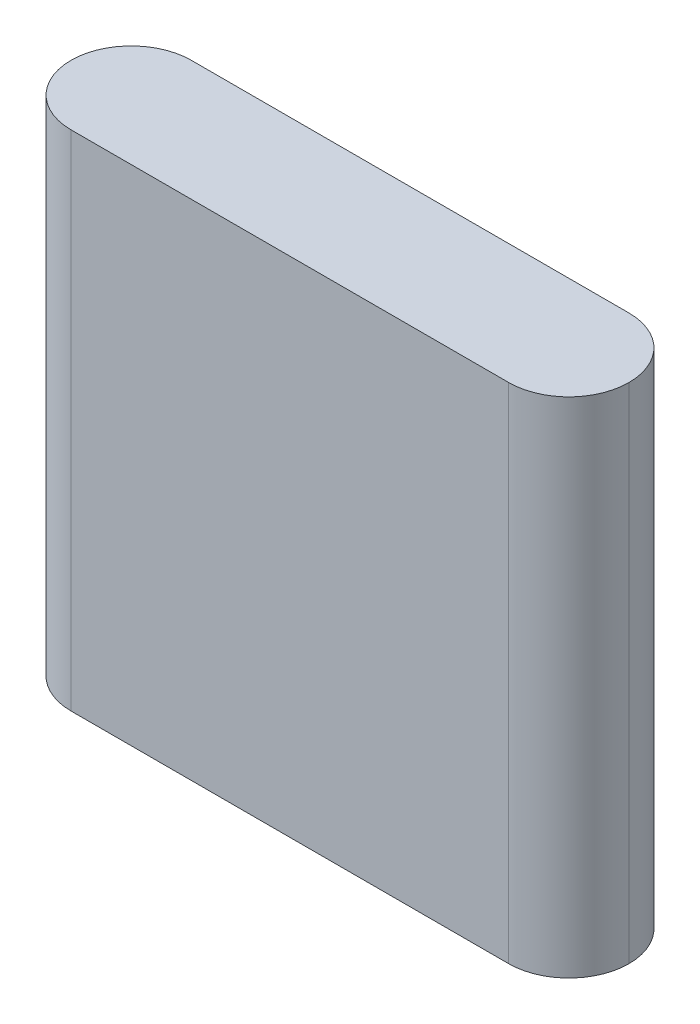
ISO-10303-21;
HEADER;
FILE_DESCRIPTION(('STEP AP214'),'2;1');
FILE_NAME('part.step','',(''),(''),'','','');
FILE_SCHEMA(('AUTOMOTIVE_DESIGN { 1 0 10303 214 1 1 1 1 }'));
ENDSEC;
DATA;
#1=APPLICATION_CONTEXT('core data for automotive mechanical design processes');
#2=APPLICATION_PROTOCOL_DEFINITION('international standard','automotive_design',2000,#1);
#3=PRODUCT_CONTEXT('',#1,'mechanical');
#4=PRODUCT('Part','Part','',(#3));
#5=PRODUCT_RELATED_PRODUCT_CATEGORY('part','',(#4));
#6=PRODUCT_DEFINITION_FORMATION('','',#4);
#7=PRODUCT_DEFINITION_CONTEXT('part definition',#1,'design');
#8=PRODUCT_DEFINITION('design','',#6,#7);
#9=PRODUCT_DEFINITION_SHAPE('','',#8);
#10=(LENGTH_UNIT() NAMED_UNIT(*) SI_UNIT(.MILLI.,.METRE.));
#11=(NAMED_UNIT(*) PLANE_ANGLE_UNIT() SI_UNIT($,.RADIAN.));
#12=(NAMED_UNIT(*) SI_UNIT($,.STERADIAN.) SOLID_ANGLE_UNIT());
#13=UNCERTAINTY_MEASURE_WITH_UNIT(LENGTH_MEASURE(1.E-05),#10,'distance_accuracy_value','');
#14=(GEOMETRIC_REPRESENTATION_CONTEXT(3) GLOBAL_UNCERTAINTY_ASSIGNED_CONTEXT((#13)) GLOBAL_UNIT_ASSIGNED_CONTEXT((#10,
#11,#12)) REPRESENTATION_CONTEXT('',''));
#15=CARTESIAN_POINT('',(0.,0.,0.));
#16=DIRECTION('',(0.,0.,1.));
#17=DIRECTION('',(1.,0.,0.));
#18=AXIS2_PLACEMENT_3D('',#15,#16,#17);
#19=CARTESIAN_POINT('',(-25.5,23.,11.));
#20=DIRECTION('',(0.,-1.,0.));
#21=DIRECTION('',(0.,0.,-1.));
#22=AXIS2_PLACEMENT_3D('',#19,#20,#21);
#23=PLANE('',#22);
#24=CARTESIAN_POINT('',(-20.,23.,5.5));
#25=DIRECTION('',(0.,-1.,0.));
#26=DIRECTION('',(0.,0.,-1.));
#27=AXIS2_PLACEMENT_3D('',#24,#25,#26);
#28=CIRCLE('',#27,5.5);
#29=CARTESIAN_POINT('',(-20.,23.,0.));
#30=VERTEX_POINT('',#29);
#31=CARTESIAN_POINT('',(-25.5,23.,5.5));
#32=VERTEX_POINT('',#31);
#33=EDGE_CURVE('E49',#30,#32,#28,.F.);
#34=ORIENTED_EDGE('',*,*,#33,.T.);
#35=CARTESIAN_POINT('',(-20.,23.,5.5));
#36=DIRECTION('',(0.,-1.,0.));
#37=DIRECTION('',(0.,0.,-1.));
#38=AXIS2_PLACEMENT_3D('',#35,#36,#37);
#39=CIRCLE('',#38,5.5);
#40=CARTESIAN_POINT('',(-20.,23.,11.));
#41=VERTEX_POINT('',#40);
#42=EDGE_CURVE('E108',#32,#41,#39,.F.);
#43=ORIENTED_EDGE('',*,*,#42,.T.);
#44=DIRECTION('',(-1.,0.,0.));
#45=VECTOR('',#44,1.);
#46=CARTESIAN_POINT('',(-25.5,23.,11.));
#47=LINE('',#46,#45);
#48=CARTESIAN_POINT('',(20.,23.,11.));
#49=VERTEX_POINT('',#48);
#50=EDGE_CURVE('E101',#49,#41,#47,.T.);
#51=ORIENTED_EDGE('',*,*,#50,.F.);
#52=CARTESIAN_POINT('',(20.,23.,5.5));
#53=DIRECTION('',(0.,-1.,0.));
#54=DIRECTION('',(0.,0.,-1.));
#55=AXIS2_PLACEMENT_3D('',#52,#53,#54);
#56=CIRCLE('',#55,5.5);
#57=CARTESIAN_POINT('',(25.5,23.,5.5));
#58=VERTEX_POINT('',#57);
#59=EDGE_CURVE('E88',#49,#58,#56,.F.);
#60=ORIENTED_EDGE('',*,*,#59,.T.);
#61=CARTESIAN_POINT('',(20.,23.,5.5));
#62=DIRECTION('',(0.,-1.,0.));
#63=DIRECTION('',(0.,0.,-1.));
#64=AXIS2_PLACEMENT_3D('',#61,#62,#63);
#65=CIRCLE('',#64,5.5);
#66=CARTESIAN_POINT('',(20.,23.,0.));
#67=VERTEX_POINT('',#66);
#68=EDGE_CURVE('E128',#58,#67,#65,.F.);
#69=ORIENTED_EDGE('',*,*,#68,.T.);
#70=DIRECTION('',(-1.,0.,0.));
#71=VECTOR('',#70,1.);
#72=CARTESIAN_POINT('',(-25.5,23.,0.));
#73=LINE('',#72,#71);
#74=EDGE_CURVE('E113',#67,#30,#73,.T.);
#75=ORIENTED_EDGE('',*,*,#74,.T.);
#76=EDGE_LOOP('',(#34,#43,#51,#60,#69,#75));
#77=FACE_BOUND('',#76,.T.);
#78=ADVANCED_FACE('F33',(#77),#23,.F.);
#79=CARTESIAN_POINT('',(-25.5,-23.,11.));
#80=DIRECTION('',(0.,1.,0.));
#81=DIRECTION('',(0.,0.,1.));
#82=AXIS2_PLACEMENT_3D('',#79,#80,#81);
#83=PLANE('',#82);
#84=DIRECTION('',(1.,0.,0.));
#85=VECTOR('',#84,1.);
#86=CARTESIAN_POINT('',(-25.5,-23.,11.));
#87=LINE('',#86,#85);
#88=CARTESIAN_POINT('',(-20.,-23.,11.));
#89=VERTEX_POINT('',#88);
#90=CARTESIAN_POINT('',(20.,-23.,11.));
#91=VERTEX_POINT('',#90);
#92=EDGE_CURVE('E104',#89,#91,#87,.T.);
#93=ORIENTED_EDGE('',*,*,#92,.F.);
#94=CARTESIAN_POINT('',(-20.,-23.,5.5));
#95=DIRECTION('',(0.,1.,0.));
#96=DIRECTION('',(0.,0.,1.));
#97=AXIS2_PLACEMENT_3D('',#94,#95,#96);
#98=CIRCLE('',#97,5.5);
#99=CARTESIAN_POINT('',(-25.5,-23.,5.5));
#100=VERTEX_POINT('',#99);
#101=EDGE_CURVE('E126',#89,#100,#98,.F.);
#102=ORIENTED_EDGE('',*,*,#101,.T.);
#103=CARTESIAN_POINT('',(-20.,-23.,5.5));
#104=DIRECTION('',(0.,1.,0.));
#105=DIRECTION('',(0.,0.,1.));
#106=AXIS2_PLACEMENT_3D('',#103,#104,#105);
#107=CIRCLE('',#106,5.5);
#108=CARTESIAN_POINT('',(-20.,-23.,0.));
#109=VERTEX_POINT('',#108);
#110=EDGE_CURVE('E124',#100,#109,#107,.F.);
#111=ORIENTED_EDGE('',*,*,#110,.T.);
#112=DIRECTION('',(1.,0.,0.));
#113=VECTOR('',#112,1.);
#114=CARTESIAN_POINT('',(-25.5,-23.,0.));
#115=LINE('',#114,#113);
#116=CARTESIAN_POINT('',(20.,-23.,0.));
#117=VERTEX_POINT('',#116);
#118=EDGE_CURVE('E109',#109,#117,#115,.T.);
#119=ORIENTED_EDGE('',*,*,#118,.T.);
#120=CARTESIAN_POINT('',(20.,-23.,5.5));
#121=DIRECTION('',(0.,1.,0.));
#122=DIRECTION('',(0.,0.,1.));
#123=AXIS2_PLACEMENT_3D('',#120,#121,#122);
#124=CIRCLE('',#123,5.5);
#125=CARTESIAN_POINT('',(25.5,-23.,5.5));
#126=VERTEX_POINT('',#125);
#127=EDGE_CURVE('E122',#117,#126,#124,.F.);
#128=ORIENTED_EDGE('',*,*,#127,.T.);
#129=CARTESIAN_POINT('',(20.,-23.,5.5));
#130=DIRECTION('',(0.,1.,0.));
#131=DIRECTION('',(0.,0.,1.));
#132=AXIS2_PLACEMENT_3D('',#129,#130,#131);
#133=CIRCLE('',#132,5.5);
#134=EDGE_CURVE('E118',#126,#91,#133,.F.);
#135=ORIENTED_EDGE('',*,*,#134,.T.);
#136=EDGE_LOOP('',(#93,#102,#111,#119,#128,#135));
#137=FACE_BOUND('',#136,.T.);
#138=ADVANCED_FACE('F137',(#137),#83,.F.);
#139=CARTESIAN_POINT('',(0.,0.,11.));
#140=DIRECTION('',(0.,0.,1.));
#141=DIRECTION('',(1.,0.,0.));
#142=AXIS2_PLACEMENT_3D('',#139,#140,#141);
#143=PLANE('',#142);
#144=ORIENTED_EDGE('',*,*,#50,.T.);
#145=DIRECTION('',(0.,-1.,0.));
#146=VECTOR('',#145,1.);
#147=CARTESIAN_POINT('',(-20.,-23.,11.));
#148=LINE('',#147,#146);
#149=EDGE_CURVE('E120',#41,#89,#148,.T.);
#150=ORIENTED_EDGE('',*,*,#149,.T.);
#151=ORIENTED_EDGE('',*,*,#92,.T.);
#152=DIRECTION('',(0.,1.,0.));
#153=VECTOR('',#152,1.);
#154=CARTESIAN_POINT('',(20.,23.,11.));
#155=LINE('',#154,#153);
#156=EDGE_CURVE('E92',#91,#49,#155,.T.);
#157=ORIENTED_EDGE('',*,*,#156,.T.);
#158=EDGE_LOOP('',(#144,#150,#151,#157));
#159=FACE_BOUND('',#158,.T.);
#160=ADVANCED_FACE('F99',(#159),#143,.T.);
#161=CARTESIAN_POINT('',(0.,0.,0.));
#162=DIRECTION('',(0.,0.,1.));
#163=DIRECTION('',(1.,0.,0.));
#164=AXIS2_PLACEMENT_3D('',#161,#162,#163);
#165=PLANE('',#164);
#166=ORIENTED_EDGE('',*,*,#118,.F.);
#167=DIRECTION('',(0.,-1.,0.));
#168=VECTOR('',#167,1.);
#169=CARTESIAN_POINT('',(-20.,0.,0.));
#170=LINE('',#169,#168);
#171=EDGE_CURVE('E11',#109,#30,#170,.F.);
#172=ORIENTED_EDGE('',*,*,#171,.T.);
#173=ORIENTED_EDGE('',*,*,#74,.F.);
#174=DIRECTION('',(0.,1.,0.));
#175=VECTOR('',#174,1.);
#176=CARTESIAN_POINT('',(20.,0.,0.));
#177=LINE('',#176,#175);
#178=EDGE_CURVE('E42',#67,#117,#177,.F.);
#179=ORIENTED_EDGE('',*,*,#178,.T.);
#180=EDGE_LOOP('',(#166,#172,#173,#179));
#181=FACE_BOUND('',#180,.T.);
#182=ADVANCED_FACE('F133',(#181),#165,.F.);
#183=CARTESIAN_POINT('',(20.,0.,5.5));
#184=DIRECTION('',(0.,-1.,0.));
#185=DIRECTION('',(1.,0.,0.));
#186=AXIS2_PLACEMENT_3D('',#183,#184,#185);
#187=CYLINDRICAL_SURFACE('',#186,5.5);
#188=ORIENTED_EDGE('',*,*,#134,.F.);
#189=DIRECTION('',(0.,1.,0.));
#190=VECTOR('',#189,1.);
#191=CARTESIAN_POINT('',(25.5,-23.,5.5));
#192=LINE('',#191,#190);
#193=EDGE_CURVE('E94',#58,#126,#192,.F.);
#194=ORIENTED_EDGE('',*,*,#193,.F.);
#195=ORIENTED_EDGE('',*,*,#59,.F.);
#196=ORIENTED_EDGE('',*,*,#156,.F.);
#197=EDGE_LOOP('',(#188,#194,#195,#196));
#198=FACE_BOUND('',#197,.T.);
#199=ADVANCED_FACE('F91',(#198),#187,.T.);
#200=CARTESIAN_POINT('',(-20.,23.,5.5));
#201=DIRECTION('',(0.,-1.,0.));
#202=DIRECTION('',(1.,0.,0.));
#203=AXIS2_PLACEMENT_3D('',#200,#201,#202);
#204=CYLINDRICAL_SURFACE('',#203,5.5);
#205=DIRECTION('',(0.,-1.,0.));
#206=VECTOR('',#205,1.);
#207=CARTESIAN_POINT('',(-25.5,23.,5.5));
#208=LINE('',#207,#206);
#209=EDGE_CURVE('E37',#32,#100,#208,.T.);
#210=ORIENTED_EDGE('',*,*,#209,.F.);
#211=ORIENTED_EDGE('',*,*,#33,.F.);
#212=ORIENTED_EDGE('',*,*,#171,.F.);
#213=ORIENTED_EDGE('',*,*,#110,.F.);
#214=EDGE_LOOP('',(#210,#211,#212,#213));
#215=FACE_BOUND('',#214,.T.);
#216=ADVANCED_FACE('F140',(#215),#204,.T.);
#217=CARTESIAN_POINT('',(-20.,0.,5.5));
#218=DIRECTION('',(0.,1.,0.));
#219=DIRECTION('',(-1.,0.,0.));
#220=AXIS2_PLACEMENT_3D('',#217,#218,#219);
#221=CYLINDRICAL_SURFACE('',#220,5.5);
#222=ORIENTED_EDGE('',*,*,#42,.F.);
#223=ORIENTED_EDGE('',*,*,#209,.T.);
#224=ORIENTED_EDGE('',*,*,#101,.F.);
#225=ORIENTED_EDGE('',*,*,#149,.F.);
#226=EDGE_LOOP('',(#222,#223,#224,#225));
#227=FACE_BOUND('',#226,.T.);
#228=ADVANCED_FACE('F143',(#227),#221,.T.);
#229=CARTESIAN_POINT('',(20.,23.,5.5));
#230=DIRECTION('',(0.,1.,0.));
#231=DIRECTION('',(-1.,0.,0.));
#232=AXIS2_PLACEMENT_3D('',#229,#230,#231);
#233=CYLINDRICAL_SURFACE('',#232,5.5);
#234=ORIENTED_EDGE('',*,*,#127,.F.);
#235=ORIENTED_EDGE('',*,*,#178,.F.);
#236=ORIENTED_EDGE('',*,*,#68,.F.);
#237=ORIENTED_EDGE('',*,*,#193,.T.);
#238=EDGE_LOOP('',(#234,#235,#236,#237));
#239=FACE_BOUND('',#238,.T.);
#240=ADVANCED_FACE('F35',(#239),#233,.T.);
#241=CLOSED_SHELL('',(#78,#138,#160,#182,#199,#216,#228,#240));
#242=MANIFOLD_SOLID_BREP('B2',#241);
#243=ADVANCED_BREP_SHAPE_REPRESENTATION('',(#18,#242),#14);
#244=SHAPE_DEFINITION_REPRESENTATION(#9,#243);
ENDSEC;
END-ISO-10303-21;
